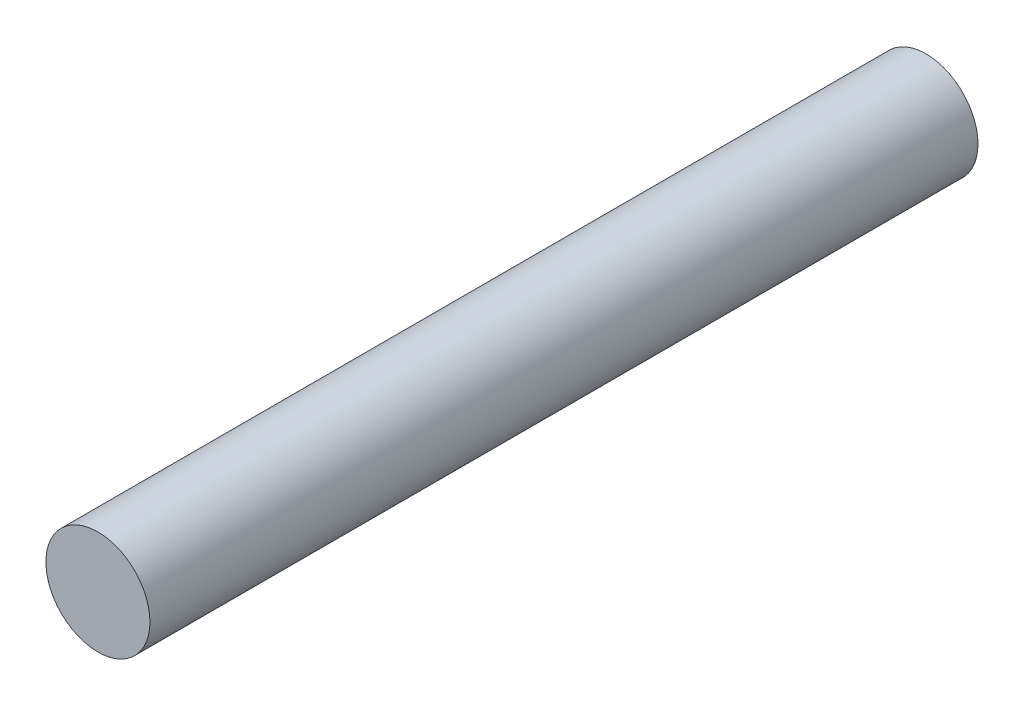
ISO-10303-21;
HEADER;
FILE_DESCRIPTION(('STEP AP214'),'2;1');
FILE_NAME('part.step','',(''),(''),'','','');
FILE_SCHEMA(('AUTOMOTIVE_DESIGN { 1 0 10303 214 1 1 1 1 }'));
ENDSEC;
DATA;
#1=APPLICATION_CONTEXT('core data for automotive mechanical design processes');
#2=APPLICATION_PROTOCOL_DEFINITION('international standard','automotive_design',2000,#1);
#3=PRODUCT_CONTEXT('',#1,'mechanical');
#4=PRODUCT('Part','Part','',(#3));
#5=PRODUCT_RELATED_PRODUCT_CATEGORY('part','',(#4));
#6=PRODUCT_DEFINITION_FORMATION('','',#4);
#7=PRODUCT_DEFINITION_CONTEXT('part definition',#1,'design');
#8=PRODUCT_DEFINITION('design','',#6,#7);
#9=PRODUCT_DEFINITION_SHAPE('','',#8);
#10=(LENGTH_UNIT() NAMED_UNIT(*) SI_UNIT(.MILLI.,.METRE.));
#11=(NAMED_UNIT(*) PLANE_ANGLE_UNIT() SI_UNIT($,.RADIAN.));
#12=(NAMED_UNIT(*) SI_UNIT($,.STERADIAN.) SOLID_ANGLE_UNIT());
#13=UNCERTAINTY_MEASURE_WITH_UNIT(LENGTH_MEASURE(1.E-05),#10,'distance_accuracy_value','');
#14=(GEOMETRIC_REPRESENTATION_CONTEXT(3) GLOBAL_UNCERTAINTY_ASSIGNED_CONTEXT((#13)) GLOBAL_UNIT_ASSIGNED_CONTEXT((#10,
#11,#12)) REPRESENTATION_CONTEXT('',''));
#15=CARTESIAN_POINT('',(0.,0.,0.));
#16=DIRECTION('',(0.,0.,1.));
#17=DIRECTION('',(1.,0.,0.));
#18=AXIS2_PLACEMENT_3D('',#15,#16,#17);
#19=CARTESIAN_POINT('',(0.,0.,50.52949));
#20=DIRECTION('',(0.,0.,-1.));
#21=DIRECTION('',(-1.,0.,0.));
#22=AXIS2_PLACEMENT_3D('',#19,#20,#21);
#23=CYLINDRICAL_SURFACE('',#22,3.175);
#24=CARTESIAN_POINT('',(0.,0.,50.52949));
#25=DIRECTION('',(0.,0.,1.));
#26=DIRECTION('',(1.,0.,0.));
#27=AXIS2_PLACEMENT_3D('',#24,#25,#26);
#28=CIRCLE('',#27,3.175);
#29=CARTESIAN_POINT('',(3.175,0.,50.52949));
#30=VERTEX_POINT('',#29);
#31=EDGE_CURVE('E10',#30,#30,#28,.T.);
#32=ORIENTED_EDGE('',*,*,#31,.F.);
#33=EDGE_LOOP('',(#32));
#34=FACE_BOUND('',#33,.T.);
#35=CARTESIAN_POINT('',(0.,0.,0.));
#36=DIRECTION('',(0.,0.,1.));
#37=DIRECTION('',(1.,0.,0.));
#38=AXIS2_PLACEMENT_3D('',#35,#36,#37);
#39=CIRCLE('',#38,3.175);
#40=CARTESIAN_POINT('',(3.175,0.,0.));
#41=VERTEX_POINT('',#40);
#42=EDGE_CURVE('E35',#41,#41,#39,.T.);
#43=ORIENTED_EDGE('',*,*,#42,.T.);
#44=EDGE_LOOP('',(#43));
#45=FACE_BOUND('',#44,.T.);
#46=ADVANCED_FACE('F32',(#34,#45),#23,.T.);
#47=CARTESIAN_POINT('',(0.,0.,50.52949));
#48=DIRECTION('',(0.,0.,1.));
#49=DIRECTION('',(1.,0.,0.));
#50=AXIS2_PLACEMENT_3D('',#47,#48,#49);
#51=PLANE('',#50);
#52=ORIENTED_EDGE('',*,*,#31,.T.);
#53=EDGE_LOOP('',(#52));
#54=FACE_BOUND('',#53,.T.);
#55=ADVANCED_FACE('F47',(#54),#51,.T.);
#56=CARTESIAN_POINT('',(0.,0.,0.));
#57=DIRECTION('',(0.,0.,1.));
#58=DIRECTION('',(1.,0.,0.));
#59=AXIS2_PLACEMENT_3D('',#56,#57,#58);
#60=PLANE('',#59);
#61=ORIENTED_EDGE('',*,*,#42,.F.);
#62=EDGE_LOOP('',(#61));
#63=FACE_BOUND('',#62,.T.);
#64=ADVANCED_FACE('F45',(#63),#60,.F.);
#65=CLOSED_SHELL('',(#46,#55,#64));
#66=MANIFOLD_SOLID_BREP('B2',#65);
#67=ADVANCED_BREP_SHAPE_REPRESENTATION('',(#18,#66),#14);
#68=SHAPE_DEFINITION_REPRESENTATION(#9,#67);
ENDSEC;
END-ISO-10303-21;
